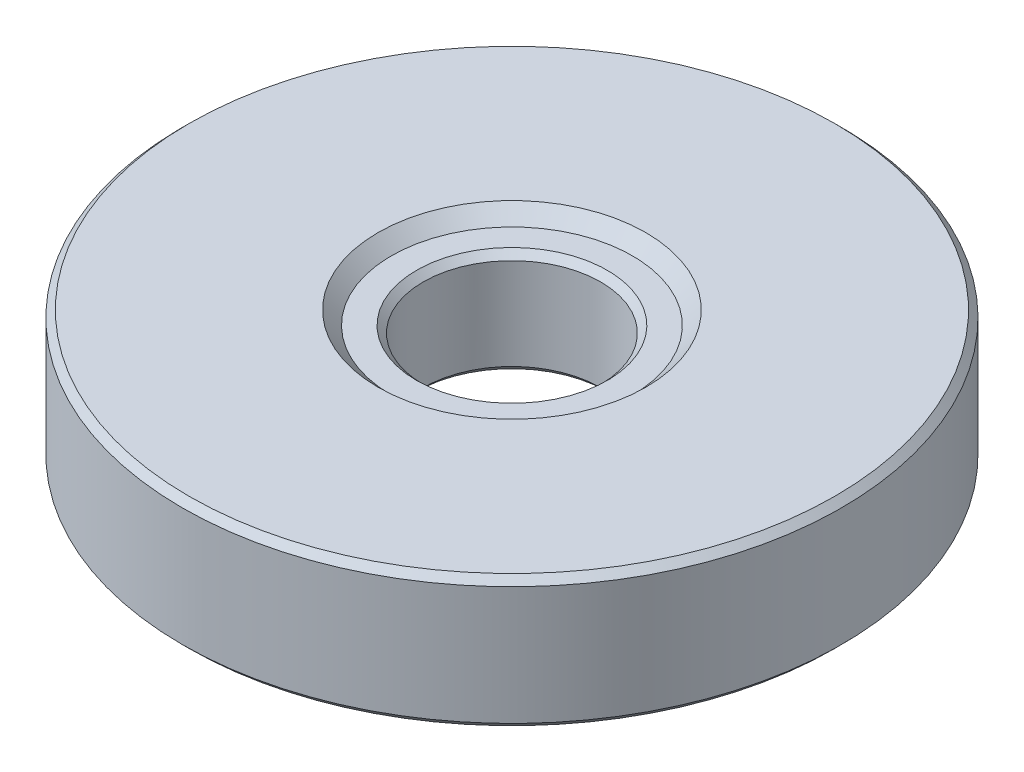
ISO-10303-21;
HEADER;
FILE_DESCRIPTION(('STEP AP214'),'2;1');
FILE_NAME('part.step','',(''),(''),'','','');
FILE_SCHEMA(('AUTOMOTIVE_DESIGN { 1 0 10303 214 1 1 1 1 }'));
ENDSEC;
DATA;
#1=APPLICATION_CONTEXT('core data for automotive mechanical design processes');
#2=APPLICATION_PROTOCOL_DEFINITION('international standard','automotive_design',2000,#1);
#3=PRODUCT_CONTEXT('',#1,'mechanical');
#4=PRODUCT('Part','Part','',(#3));
#5=PRODUCT_RELATED_PRODUCT_CATEGORY('part','',(#4));
#6=PRODUCT_DEFINITION_FORMATION('','',#4);
#7=PRODUCT_DEFINITION_CONTEXT('part definition',#1,'design');
#8=PRODUCT_DEFINITION('design','',#6,#7);
#9=PRODUCT_DEFINITION_SHAPE('','',#8);
#10=(LENGTH_UNIT() NAMED_UNIT(*) SI_UNIT(.MILLI.,.METRE.));
#11=(NAMED_UNIT(*) PLANE_ANGLE_UNIT() SI_UNIT($,.RADIAN.));
#12=(NAMED_UNIT(*) SI_UNIT($,.STERADIAN.) SOLID_ANGLE_UNIT());
#13=UNCERTAINTY_MEASURE_WITH_UNIT(LENGTH_MEASURE(1.E-05),#10,'distance_accuracy_value','');
#14=(GEOMETRIC_REPRESENTATION_CONTEXT(3) GLOBAL_UNCERTAINTY_ASSIGNED_CONTEXT((#13)) GLOBAL_UNIT_ASSIGNED_CONTEXT((#10,
#11,#12)) REPRESENTATION_CONTEXT('',''));
#15=CARTESIAN_POINT('',(0.,0.,0.));
#16=DIRECTION('',(0.,0.,1.));
#17=DIRECTION('',(1.,0.,0.));
#18=AXIS2_PLACEMENT_3D('',#15,#16,#17);
#19=CARTESIAN_POINT('',(-8.537339258055,17.4982346195393,-5.68494248824436));
#20=DIRECTION('',(0.,-1.,0.));
#21=DIRECTION('',(0.,0.,-1.));
#22=AXIS2_PLACEMENT_3D('',#19,#20,#21);
#23=CYLINDRICAL_SURFACE('',#22,12.5);
#24=CARTESIAN_POINT('',(-8.537339258055,12.7534145435393,-5.68494248824436));
#25=DIRECTION('',(0.,1.,0.));
#26=DIRECTION('',(0.,0.,1.));
#27=AXIS2_PLACEMENT_3D('',#24,#25,#26);
#28=CIRCLE('',#27,12.5);
#29=CARTESIAN_POINT('',(-8.537339258055,12.7534145435393,6.81505751175564));
#30=VERTEX_POINT('',#29);
#31=EDGE_CURVE('E25',#30,#30,#28,.T.);
#32=ORIENTED_EDGE('',*,*,#31,.T.);
#33=EDGE_LOOP('',(#32));
#34=FACE_BOUND('',#33,.T.);
#35=CARTESIAN_POINT('',(-8.537339258055,17.2442346195393,-5.68494248824436));
#36=DIRECTION('',(0.,1.,0.));
#37=DIRECTION('',(0.,0.,1.));
#38=AXIS2_PLACEMENT_3D('',#35,#36,#37);
#39=CIRCLE('',#38,12.5);
#40=CARTESIAN_POINT('',(-8.537339258055,17.2442346195393,6.81505751175564));
#41=VERTEX_POINT('',#40);
#42=EDGE_CURVE('E29',#41,#41,#39,.F.);
#43=ORIENTED_EDGE('',*,*,#42,.T.);
#44=EDGE_LOOP('',(#43));
#45=FACE_BOUND('',#44,.T.);
#46=ADVANCED_FACE('F14',(#34,#45),#23,.T.);
#47=CARTESIAN_POINT('',(-8.537339258055,17.4982346195393,-5.68494248824436));
#48=DIRECTION('',(0.,1.,0.));
#49=DIRECTION('',(0.,0.,1.));
#50=AXIS2_PLACEMENT_3D('',#47,#48,#49);
#51=PLANE('',#50);
#52=CARTESIAN_POINT('',(-8.537339258055,17.4982346195393,-5.68494248824436));
#53=DIRECTION('',(0.,1.,0.));
#54=DIRECTION('',(0.,0.,1.));
#55=AXIS2_PLACEMENT_3D('',#52,#53,#54);
#56=CIRCLE('',#55,12.246);
#57=CARTESIAN_POINT('',(-8.537339258055,17.4982346195393,6.56105751175564));
#58=VERTEX_POINT('',#57);
#59=EDGE_CURVE('E10',#58,#58,#56,.T.);
#60=ORIENTED_EDGE('',*,*,#59,.T.);
#61=EDGE_LOOP('',(#60));
#62=FACE_BOUND('',#61,.T.);
#63=CARTESIAN_POINT('',(-8.537339258055,17.4982346195393,-5.68494248824436));
#64=DIRECTION('',(0.,1.,0.));
#65=DIRECTION('',(0.,0.,1.));
#66=AXIS2_PLACEMENT_3D('',#63,#64,#65);
#67=CIRCLE('',#66,5.08);
#68=CARTESIAN_POINT('',(-8.537339258055,17.4982346195393,-0.60494248824436));
#69=VERTEX_POINT('',#68);
#70=EDGE_CURVE('E55',#69,#69,#67,.T.);
#71=ORIENTED_EDGE('',*,*,#70,.F.);
#72=EDGE_LOOP('',(#71));
#73=FACE_BOUND('',#72,.T.);
#74=ADVANCED_FACE('F62',(#62,#73),#51,.T.);
#75=CARTESIAN_POINT('',(-8.537339258055,12.4994145435393,-5.68494248824436));
#76=DIRECTION('',(0.,1.,0.));
#77=DIRECTION('',(0.,0.,1.));
#78=AXIS2_PLACEMENT_3D('',#75,#76,#77);
#79=PLANE('',#78);
#80=CARTESIAN_POINT('',(-8.537339258055,12.4994145435393,-5.68494248824436));
#81=DIRECTION('',(0.,1.,0.));
#82=DIRECTION('',(0.,0.,1.));
#83=AXIS2_PLACEMENT_3D('',#80,#81,#82);
#84=CIRCLE('',#83,12.246);
#85=CARTESIAN_POINT('',(-8.537339258055,12.4994145435393,6.56105751175564));
#86=VERTEX_POINT('',#85);
#87=EDGE_CURVE('E21',#86,#86,#84,.F.);
#88=ORIENTED_EDGE('',*,*,#87,.T.);
#89=EDGE_LOOP('',(#88));
#90=FACE_BOUND('',#89,.T.);
#91=CARTESIAN_POINT('',(-8.537339258055,12.4994145435393,-5.68494248824436));
#92=DIRECTION('',(0.,-1.,0.));
#93=DIRECTION('',(0.,0.,-1.));
#94=AXIS2_PLACEMENT_3D('',#91,#92,#93);
#95=CIRCLE('',#94,5.08);
#96=CARTESIAN_POINT('',(-8.537339258055,12.4994145435393,-10.7649424882444));
#97=VERTEX_POINT('',#96);
#98=EDGE_CURVE('E52',#97,#97,#95,.T.);
#99=ORIENTED_EDGE('',*,*,#98,.F.);
#100=EDGE_LOOP('',(#99));
#101=FACE_BOUND('',#100,.T.);
#102=ADVANCED_FACE('F64',(#90,#101),#79,.F.);
#103=CARTESIAN_POINT('',(-8.537339258055,13.0074145435393,-5.68494248824436));
#104=DIRECTION('',(0.,-1.,0.));
#105=DIRECTION('',(0.,0.,-1.));
#106=AXIS2_PLACEMENT_3D('',#103,#104,#105);
#107=PLANE('',#106);
#108=CARTESIAN_POINT('',(-8.537339258055,13.0074145435393,-5.68494248824436));
#109=DIRECTION('',(0.,-1.,0.));
#110=DIRECTION('',(0.,0.,-1.));
#111=AXIS2_PLACEMENT_3D('',#108,#109,#110);
#112=CIRCLE('',#111,3.6195);
#113=CARTESIAN_POINT('',(-8.537339258055,13.0074145435393,-9.30444248824436));
#114=VERTEX_POINT('',#113);
#115=EDGE_CURVE('E34',#114,#114,#112,.F.);
#116=ORIENTED_EDGE('',*,*,#115,.T.);
#117=EDGE_LOOP('',(#116));
#118=FACE_BOUND('',#117,.T.);
#119=CARTESIAN_POINT('',(-8.537339258055,13.0074145435393,-5.68494248824436));
#120=DIRECTION('',(0.,-1.,0.));
#121=DIRECTION('',(0.,0.,-1.));
#122=AXIS2_PLACEMENT_3D('',#119,#120,#121);
#123=CIRCLE('',#122,4.572);
#124=CARTESIAN_POINT('',(-8.537339258055,13.0074145435393,-10.2569424882444));
#125=VERTEX_POINT('',#124);
#126=EDGE_CURVE('E46',#125,#125,#123,.T.);
#127=ORIENTED_EDGE('',*,*,#126,.T.);
#128=EDGE_LOOP('',(#127));
#129=FACE_BOUND('',#128,.T.);
#130=ADVANCED_FACE('F71',(#118,#129),#107,.T.);
#131=CARTESIAN_POINT('',(-8.537339258055,16.9902346195393,-5.68494248824436));
#132=DIRECTION('',(0.,1.,0.));
#133=DIRECTION('',(0.,0.,1.));
#134=AXIS2_PLACEMENT_3D('',#131,#132,#133);
#135=PLANE('',#134);
#136=CARTESIAN_POINT('',(-8.537339258055,16.9902346195393,-5.68494248824436));
#137=DIRECTION('',(0.,1.,0.));
#138=DIRECTION('',(0.,0.,1.));
#139=AXIS2_PLACEMENT_3D('',#136,#137,#138);
#140=CIRCLE('',#139,3.6195);
#141=CARTESIAN_POINT('',(-8.537339258055,16.9902346195393,-2.06544248824436));
#142=VERTEX_POINT('',#141);
#143=EDGE_CURVE('E37',#142,#142,#140,.F.);
#144=ORIENTED_EDGE('',*,*,#143,.T.);
#145=EDGE_LOOP('',(#144));
#146=FACE_BOUND('',#145,.T.);
#147=CARTESIAN_POINT('',(-8.537339258055,16.9902346195393,-5.68494248824436));
#148=DIRECTION('',(0.,1.,0.));
#149=DIRECTION('',(0.,0.,1.));
#150=AXIS2_PLACEMENT_3D('',#147,#148,#149);
#151=CIRCLE('',#150,4.572);
#152=CARTESIAN_POINT('',(-8.537339258055,16.9902346195393,-1.11294248824436));
#153=VERTEX_POINT('',#152);
#154=EDGE_CURVE('E49',#153,#153,#151,.T.);
#155=ORIENTED_EDGE('',*,*,#154,.T.);
#156=EDGE_LOOP('',(#155));
#157=FACE_BOUND('',#156,.T.);
#158=ADVANCED_FACE('F81',(#146,#157),#135,.T.);
#159=CARTESIAN_POINT('',(-8.537339258055,16.9902346195393,-5.68494248824436));
#160=DIRECTION('',(0.,1.,0.));
#161=DIRECTION('',(0.,0.,1.));
#162=AXIS2_PLACEMENT_3D('',#159,#160,#161);
#163=CONICAL_SURFACE('',#162,4.572,0.785398163397448);
#164=ORIENTED_EDGE('',*,*,#70,.T.);
#165=EDGE_LOOP('',(#164));
#166=FACE_BOUND('',#165,.T.);
#167=ORIENTED_EDGE('',*,*,#154,.F.);
#168=EDGE_LOOP('',(#167));
#169=FACE_BOUND('',#168,.T.);
#170=ADVANCED_FACE('F59',(#166,#169),#163,.F.);
#171=CARTESIAN_POINT('',(-8.537339258055,13.0074145435393,-5.68494248824436));
#172=DIRECTION('',(0.,-1.,0.));
#173=DIRECTION('',(0.,0.,-1.));
#174=AXIS2_PLACEMENT_3D('',#171,#172,#173);
#175=CONICAL_SURFACE('',#174,4.572,0.785398163397449);
#176=ORIENTED_EDGE('',*,*,#98,.T.);
#177=EDGE_LOOP('',(#176));
#178=FACE_BOUND('',#177,.T.);
#179=ORIENTED_EDGE('',*,*,#126,.F.);
#180=EDGE_LOOP('',(#179));
#181=FACE_BOUND('',#180,.T.);
#182=ADVANCED_FACE('F80',(#178,#181),#175,.F.);
#183=CARTESIAN_POINT('',(-8.537339258055,17.4982346195393,-5.68494248824436));
#184=DIRECTION('',(0.,-1.,0.));
#185=DIRECTION('',(0.,0.,-1.));
#186=AXIS2_PLACEMENT_3D('',#183,#184,#185);
#187=CYLINDRICAL_SURFACE('',#186,3.3655);
#188=CARTESIAN_POINT('',(-8.537339258055,16.7362346195393,-5.68494248824436));
#189=DIRECTION('',(0.,1.,0.));
#190=DIRECTION('',(0.,0.,1.));
#191=AXIS2_PLACEMENT_3D('',#188,#189,#190);
#192=CIRCLE('',#191,3.3655);
#193=CARTESIAN_POINT('',(-8.537339258055,16.7362346195393,-2.31944248824436));
#194=VERTEX_POINT('',#193);
#195=EDGE_CURVE('E40',#194,#194,#192,.T.);
#196=ORIENTED_EDGE('',*,*,#195,.T.);
#197=EDGE_LOOP('',(#196));
#198=FACE_BOUND('',#197,.T.);
#199=CARTESIAN_POINT('',(-8.537339258055,13.2614145435393,-5.68494248824436));
#200=DIRECTION('',(0.,-1.,0.));
#201=DIRECTION('',(0.,0.,-1.));
#202=AXIS2_PLACEMENT_3D('',#199,#200,#201);
#203=CIRCLE('',#202,3.3655);
#204=CARTESIAN_POINT('',(-8.537339258055,13.2614145435393,-9.05044248824436));
#205=VERTEX_POINT('',#204);
#206=EDGE_CURVE('E43',#205,#205,#203,.T.);
#207=ORIENTED_EDGE('',*,*,#206,.T.);
#208=EDGE_LOOP('',(#207));
#209=FACE_BOUND('',#208,.T.);
#210=ADVANCED_FACE('F84',(#198,#209),#187,.F.);
#211=CARTESIAN_POINT('',(-8.537339258055,16.7362346195393,-5.68494248824436));
#212=DIRECTION('',(0.,1.,0.));
#213=DIRECTION('',(0.,0.,1.));
#214=AXIS2_PLACEMENT_3D('',#211,#212,#213);
#215=CONICAL_SURFACE('',#214,3.3655,0.785398163397448);
#216=ORIENTED_EDGE('',*,*,#143,.F.);
#217=EDGE_LOOP('',(#216));
#218=FACE_BOUND('',#217,.T.);
#219=ORIENTED_EDGE('',*,*,#195,.F.);
#220=EDGE_LOOP('',(#219));
#221=FACE_BOUND('',#220,.T.);
#222=ADVANCED_FACE('F86',(#218,#221),#215,.F.);
#223=CARTESIAN_POINT('',(-8.537339258055,13.2614145435393,-5.68494248824436));
#224=DIRECTION('',(0.,-1.,0.));
#225=DIRECTION('',(0.,0.,-1.));
#226=AXIS2_PLACEMENT_3D('',#223,#224,#225);
#227=CONICAL_SURFACE('',#226,3.3655,0.785398163397442);
#228=ORIENTED_EDGE('',*,*,#115,.F.);
#229=EDGE_LOOP('',(#228));
#230=FACE_BOUND('',#229,.T.);
#231=ORIENTED_EDGE('',*,*,#206,.F.);
#232=EDGE_LOOP('',(#231));
#233=FACE_BOUND('',#232,.T.);
#234=ADVANCED_FACE('F89',(#230,#233),#227,.F.);
#235=CARTESIAN_POINT('',(-8.537339258055,12.7534145435393,-5.68494248824436));
#236=DIRECTION('',(0.,1.,0.));
#237=DIRECTION('',(0.,0.,1.));
#238=AXIS2_PLACEMENT_3D('',#235,#236,#237);
#239=CONICAL_SURFACE('',#238,12.5,0.785398163397445);
#240=ORIENTED_EDGE('',*,*,#87,.F.);
#241=EDGE_LOOP('',(#240));
#242=FACE_BOUND('',#241,.T.);
#243=ORIENTED_EDGE('',*,*,#31,.F.);
#244=EDGE_LOOP('',(#243));
#245=FACE_BOUND('',#244,.T.);
#246=ADVANCED_FACE('F92',(#242,#245),#239,.T.);
#247=CARTESIAN_POINT('',(-8.537339258055,17.4982346195393,-5.68494248824436));
#248=DIRECTION('',(0.,-1.,0.));
#249=DIRECTION('',(0.,0.,-1.));
#250=AXIS2_PLACEMENT_3D('',#247,#248,#249);
#251=CONICAL_SURFACE('',#250,12.246,0.785398163397448);
#252=ORIENTED_EDGE('',*,*,#42,.F.);
#253=EDGE_LOOP('',(#252));
#254=FACE_BOUND('',#253,.T.);
#255=ORIENTED_EDGE('',*,*,#59,.F.);
#256=EDGE_LOOP('',(#255));
#257=FACE_BOUND('',#256,.T.);
#258=ADVANCED_FACE('F16',(#254,#257),#251,.T.);
#259=CLOSED_SHELL('',(#46,#74,#102,#130,#158,#170,#182,#210,#222,#234,#246,#258));
#260=MANIFOLD_SOLID_BREP('B1',#259);
#261=ADVANCED_BREP_SHAPE_REPRESENTATION('',(#18,#260),#14);
#262=SHAPE_DEFINITION_REPRESENTATION(#9,#261);
ENDSEC;
END-ISO-10303-21;
